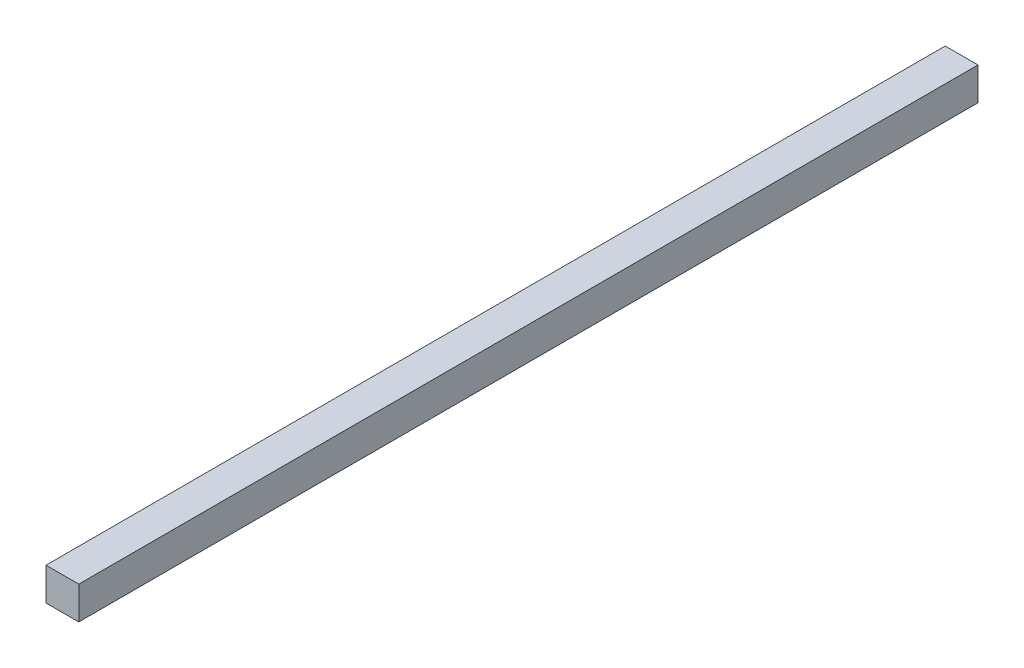
ISO-10303-21;
HEADER;
FILE_DESCRIPTION(('STEP AP214'),'2;1');
FILE_NAME('part.step','',(''),(''),'','','');
FILE_SCHEMA(('AUTOMOTIVE_DESIGN { 1 0 10303 214 1 1 1 1 }'));
ENDSEC;
DATA;
#1=APPLICATION_CONTEXT('core data for automotive mechanical design processes');
#2=APPLICATION_PROTOCOL_DEFINITION('international standard','automotive_design',2000,#1);
#3=PRODUCT_CONTEXT('',#1,'mechanical');
#4=PRODUCT('Part','Part','',(#3));
#5=PRODUCT_RELATED_PRODUCT_CATEGORY('part','',(#4));
#6=PRODUCT_DEFINITION_FORMATION('','',#4);
#7=PRODUCT_DEFINITION_CONTEXT('part definition',#1,'design');
#8=PRODUCT_DEFINITION('design','',#6,#7);
#9=PRODUCT_DEFINITION_SHAPE('','',#8);
#10=(LENGTH_UNIT() NAMED_UNIT(*) SI_UNIT(.MILLI.,.METRE.));
#11=(NAMED_UNIT(*) PLANE_ANGLE_UNIT() SI_UNIT($,.RADIAN.));
#12=(NAMED_UNIT(*) SI_UNIT($,.STERADIAN.) SOLID_ANGLE_UNIT());
#13=UNCERTAINTY_MEASURE_WITH_UNIT(LENGTH_MEASURE(1.E-05),#10,'distance_accuracy_value','');
#14=(GEOMETRIC_REPRESENTATION_CONTEXT(3) GLOBAL_UNCERTAINTY_ASSIGNED_CONTEXT((#13)) GLOBAL_UNIT_ASSIGNED_CONTEXT((#10,
#11,#12)) REPRESENTATION_CONTEXT('',''));
#15=CARTESIAN_POINT('',(0.,0.,0.));
#16=DIRECTION('',(0.,0.,1.));
#17=DIRECTION('',(1.,0.,0.));
#18=AXIS2_PLACEMENT_3D('',#15,#16,#17);
#19=CARTESIAN_POINT('',(0.,88.9,0.));
#20=DIRECTION('',(1.,0.,0.));
#21=DIRECTION('',(0.,0.,-1.));
#22=AXIS2_PLACEMENT_3D('',#19,#20,#21);
#23=PLANE('',#22);
#24=DIRECTION('',(0.,0.,1.));
#25=VECTOR('',#24,1.);
#26=CARTESIAN_POINT('',(0.,0.,0.));
#27=LINE('',#26,#25);
#28=CARTESIAN_POINT('',(0.,0.,0.));
#29=VERTEX_POINT('',#28);
#30=CARTESIAN_POINT('',(2.98617875504091E-13,0.,2438.4));
#31=VERTEX_POINT('',#30);
#32=EDGE_CURVE('E95',#29,#31,#27,.T.);
#33=ORIENTED_EDGE('',*,*,#32,.T.);
#34=DIRECTION('',(0.,-1.,0.));
#35=VECTOR('',#34,1.);
#36=CARTESIAN_POINT('',(2.98617875504091E-13,88.9,2438.4));
#37=LINE('',#36,#35);
#38=CARTESIAN_POINT('',(2.98617875504091E-13,88.9,2438.4));
#39=VERTEX_POINT('',#38);
#40=EDGE_CURVE('E11',#39,#31,#37,.T.);
#41=ORIENTED_EDGE('',*,*,#40,.F.);
#42=DIRECTION('',(0.,0.,1.));
#43=VECTOR('',#42,1.);
#44=CARTESIAN_POINT('',(0.,88.9,0.));
#45=LINE('',#44,#43);
#46=CARTESIAN_POINT('',(0.,88.9,0.));
#47=VERTEX_POINT('',#46);
#48=EDGE_CURVE('E83',#47,#39,#45,.T.);
#49=ORIENTED_EDGE('',*,*,#48,.F.);
#50=DIRECTION('',(0.,-1.,0.));
#51=VECTOR('',#50,1.);
#52=CARTESIAN_POINT('',(0.,88.9,0.));
#53=LINE('',#52,#51);
#54=EDGE_CURVE('E91',#47,#29,#53,.T.);
#55=ORIENTED_EDGE('',*,*,#54,.T.);
#56=EDGE_LOOP('',(#33,#41,#49,#55));
#57=FACE_BOUND('',#56,.T.);
#58=ADVANCED_FACE('F32',(#57),#23,.F.);
#59=CARTESIAN_POINT('',(2.98617875504091E-13,88.9,2438.4));
#60=DIRECTION('',(0.,0.,-1.));
#61=DIRECTION('',(-1.,0.,0.));
#62=AXIS2_PLACEMENT_3D('',#59,#60,#61);
#63=PLANE('',#62);
#64=DIRECTION('',(1.,0.,0.));
#65=VECTOR('',#64,1.);
#66=CARTESIAN_POINT('',(2.98617875504091E-13,0.,2438.4));
#67=LINE('',#66,#65);
#68=CARTESIAN_POINT('',(88.9000000000003,0.,2438.4));
#69=VERTEX_POINT('',#68);
#70=EDGE_CURVE('E87',#31,#69,#67,.T.);
#71=ORIENTED_EDGE('',*,*,#70,.T.);
#72=DIRECTION('',(0.,-1.,0.));
#73=VECTOR('',#72,1.);
#74=CARTESIAN_POINT('',(88.9000000000003,88.9,2438.4));
#75=LINE('',#74,#73);
#76=CARTESIAN_POINT('',(88.9000000000003,88.9,2438.4));
#77=VERTEX_POINT('',#76);
#78=EDGE_CURVE('E40',#77,#69,#75,.T.);
#79=ORIENTED_EDGE('',*,*,#78,.F.);
#80=DIRECTION('',(1.,0.,0.));
#81=VECTOR('',#80,1.);
#82=CARTESIAN_POINT('',(2.98617875504091E-13,88.9,2438.4));
#83=LINE('',#82,#81);
#84=EDGE_CURVE('E78',#39,#77,#83,.T.);
#85=ORIENTED_EDGE('',*,*,#84,.F.);
#86=ORIENTED_EDGE('',*,*,#40,.T.);
#87=EDGE_LOOP('',(#71,#79,#85,#86));
#88=FACE_BOUND('',#87,.T.);
#89=ADVANCED_FACE('F86',(#88),#63,.F.);
#90=CARTESIAN_POINT('',(88.9,88.9,0.));
#91=DIRECTION('',(-1.,0.,0.));
#92=DIRECTION('',(0.,0.,1.));
#93=AXIS2_PLACEMENT_3D('',#90,#91,#92);
#94=PLANE('',#93);
#95=DIRECTION('',(0.,0.,-1.));
#96=VECTOR('',#95,1.);
#97=CARTESIAN_POINT('',(88.9,0.,0.));
#98=LINE('',#97,#96);
#99=CARTESIAN_POINT('',(88.9,0.,0.));
#100=VERTEX_POINT('',#99);
#101=EDGE_CURVE('E65',#69,#100,#98,.T.);
#102=ORIENTED_EDGE('',*,*,#101,.T.);
#103=DIRECTION('',(0.,-1.,0.));
#104=VECTOR('',#103,1.);
#105=CARTESIAN_POINT('',(88.9,88.9,0.));
#106=LINE('',#105,#104);
#107=CARTESIAN_POINT('',(88.9,88.9,0.));
#108=VERTEX_POINT('',#107);
#109=EDGE_CURVE('E88',#108,#100,#106,.T.);
#110=ORIENTED_EDGE('',*,*,#109,.F.);
#111=DIRECTION('',(0.,0.,-1.));
#112=VECTOR('',#111,1.);
#113=CARTESIAN_POINT('',(88.9,88.9,0.));
#114=LINE('',#113,#112);
#115=EDGE_CURVE('E81',#77,#108,#114,.T.);
#116=ORIENTED_EDGE('',*,*,#115,.F.);
#117=ORIENTED_EDGE('',*,*,#78,.T.);
#118=EDGE_LOOP('',(#102,#110,#116,#117));
#119=FACE_BOUND('',#118,.T.);
#120=ADVANCED_FACE('F89',(#119),#94,.F.);
#121=CARTESIAN_POINT('',(0.,88.9,0.));
#122=DIRECTION('',(0.,0.,1.));
#123=DIRECTION('',(1.,0.,0.));
#124=AXIS2_PLACEMENT_3D('',#121,#122,#123);
#125=PLANE('',#124);
#126=DIRECTION('',(-1.,0.,0.));
#127=VECTOR('',#126,1.);
#128=CARTESIAN_POINT('',(0.,0.,0.));
#129=LINE('',#128,#127);
#130=EDGE_CURVE('E71',#100,#29,#129,.T.);
#131=ORIENTED_EDGE('',*,*,#130,.T.);
#132=ORIENTED_EDGE('',*,*,#54,.F.);
#133=DIRECTION('',(-1.,0.,0.));
#134=VECTOR('',#133,1.);
#135=CARTESIAN_POINT('',(0.,88.9,0.));
#136=LINE('',#135,#134);
#137=EDGE_CURVE('E48',#108,#47,#136,.T.);
#138=ORIENTED_EDGE('',*,*,#137,.F.);
#139=ORIENTED_EDGE('',*,*,#109,.T.);
#140=EDGE_LOOP('',(#131,#132,#138,#139));
#141=FACE_BOUND('',#140,.T.);
#142=ADVANCED_FACE('F102',(#141),#125,.F.);
#143=CARTESIAN_POINT('',(0.,88.9,0.));
#144=DIRECTION('',(0.,1.,0.));
#145=DIRECTION('',(0.,0.,1.));
#146=AXIS2_PLACEMENT_3D('',#143,#144,#145);
#147=PLANE('',#146);
#148=ORIENTED_EDGE('',*,*,#48,.T.);
#149=ORIENTED_EDGE('',*,*,#84,.T.);
#150=ORIENTED_EDGE('',*,*,#115,.T.);
#151=ORIENTED_EDGE('',*,*,#137,.T.);
#152=EDGE_LOOP('',(#148,#149,#150,#151));
#153=FACE_BOUND('',#152,.T.);
#154=ADVANCED_FACE('F79',(#153),#147,.T.);
#155=CARTESIAN_POINT('',(0.,0.,0.));
#156=DIRECTION('',(0.,1.,0.));
#157=DIRECTION('',(0.,0.,1.));
#158=AXIS2_PLACEMENT_3D('',#155,#156,#157);
#159=PLANE('',#158);
#160=ORIENTED_EDGE('',*,*,#32,.F.);
#161=ORIENTED_EDGE('',*,*,#130,.F.);
#162=ORIENTED_EDGE('',*,*,#101,.F.);
#163=ORIENTED_EDGE('',*,*,#70,.F.);
#164=EDGE_LOOP('',(#160,#161,#162,#163));
#165=FACE_BOUND('',#164,.T.);
#166=ADVANCED_FACE('F105',(#165),#159,.F.);
#167=CLOSED_SHELL('',(#58,#89,#120,#142,#154,#166));
#168=MANIFOLD_SOLID_BREP('B2',#167);
#169=ADVANCED_BREP_SHAPE_REPRESENTATION('',(#18,#168),#14);
#170=SHAPE_DEFINITION_REPRESENTATION(#9,#169);
ENDSEC;
END-ISO-10303-21;
